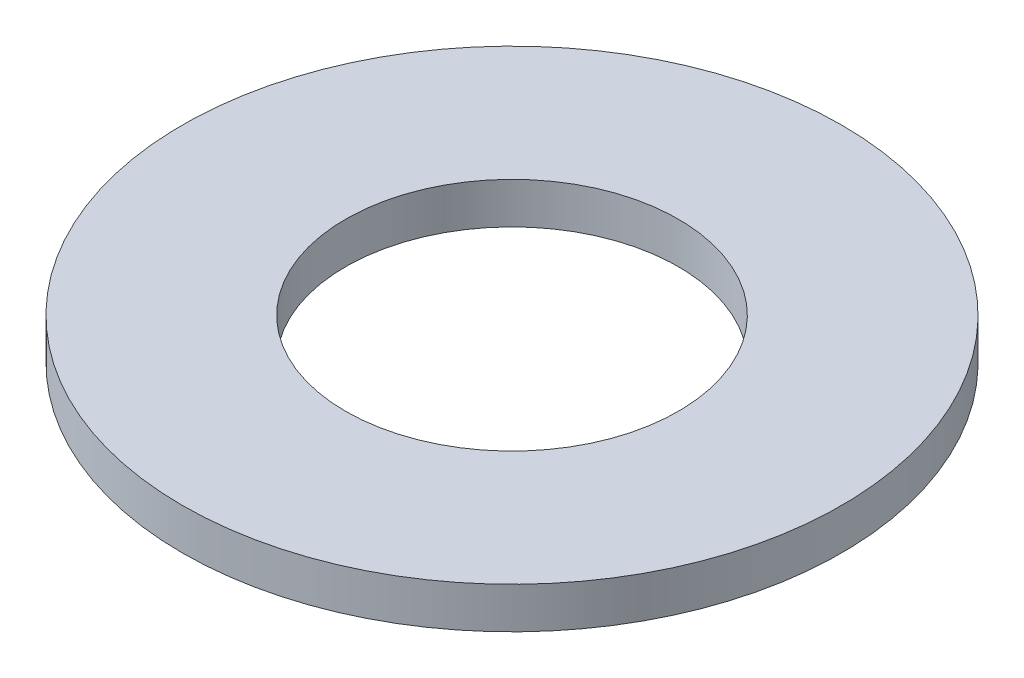
ISO-10303-21;
HEADER;
FILE_DESCRIPTION(('STEP AP214'),'2;1');
FILE_NAME('part.step','',(''),(''),'','','');
FILE_SCHEMA(('AUTOMOTIVE_DESIGN { 1 0 10303 214 1 1 1 1 }'));
ENDSEC;
DATA;
#1=APPLICATION_CONTEXT('core data for automotive mechanical design processes');
#2=APPLICATION_PROTOCOL_DEFINITION('international standard','automotive_design',2000,#1);
#3=PRODUCT_CONTEXT('',#1,'mechanical');
#4=PRODUCT('Part','Part','',(#3));
#5=PRODUCT_RELATED_PRODUCT_CATEGORY('part','',(#4));
#6=PRODUCT_DEFINITION_FORMATION('','',#4);
#7=PRODUCT_DEFINITION_CONTEXT('part definition',#1,'design');
#8=PRODUCT_DEFINITION('design','',#6,#7);
#9=PRODUCT_DEFINITION_SHAPE('','',#8);
#10=(LENGTH_UNIT() NAMED_UNIT(*) SI_UNIT(.MILLI.,.METRE.));
#11=(NAMED_UNIT(*) PLANE_ANGLE_UNIT() SI_UNIT($,.RADIAN.));
#12=(NAMED_UNIT(*) SI_UNIT($,.STERADIAN.) SOLID_ANGLE_UNIT());
#13=UNCERTAINTY_MEASURE_WITH_UNIT(LENGTH_MEASURE(1.E-05),#10,'distance_accuracy_value','');
#14=(GEOMETRIC_REPRESENTATION_CONTEXT(3) GLOBAL_UNCERTAINTY_ASSIGNED_CONTEXT((#13)) GLOBAL_UNIT_ASSIGNED_CONTEXT((#10,
#11,#12)) REPRESENTATION_CONTEXT('',''));
#15=CARTESIAN_POINT('',(0.,0.,0.));
#16=DIRECTION('',(0.,0.,1.));
#17=DIRECTION('',(1.,0.,0.));
#18=AXIS2_PLACEMENT_3D('',#15,#16,#17);
#19=CARTESIAN_POINT('',(0.,0.79375,0.));
#20=DIRECTION('',(0.,1.,0.));
#21=DIRECTION('',(0.,0.,1.));
#22=AXIS2_PLACEMENT_3D('',#19,#20,#21);
#23=PLANE('',#22);
#24=CARTESIAN_POINT('',(0.,0.79375,0.));
#25=DIRECTION('',(0.,1.,0.));
#26=DIRECTION('',(0.,0.,1.));
#27=AXIS2_PLACEMENT_3D('',#24,#25,#26);
#28=CIRCLE('',#27,12.7);
#29=CARTESIAN_POINT('',(0.,0.79375,12.7));
#30=VERTEX_POINT('',#29);
#31=EDGE_CURVE('E10',#30,#30,#28,.T.);
#32=ORIENTED_EDGE('',*,*,#31,.T.);
#33=EDGE_LOOP('',(#32));
#34=FACE_BOUND('',#33,.T.);
#35=CARTESIAN_POINT('',(0.,0.79375,0.));
#36=DIRECTION('',(0.,1.,0.));
#37=DIRECTION('',(0.,0.,1.));
#38=AXIS2_PLACEMENT_3D('',#35,#36,#37);
#39=CIRCLE('',#38,6.4135);
#40=CARTESIAN_POINT('',(0.,0.79375,6.4135));
#41=VERTEX_POINT('',#40);
#42=EDGE_CURVE('E48',#41,#41,#39,.T.);
#43=ORIENTED_EDGE('',*,*,#42,.F.);
#44=EDGE_LOOP('',(#43));
#45=FACE_BOUND('',#44,.T.);
#46=ADVANCED_FACE('F37',(#34,#45),#23,.T.);
#47=CARTESIAN_POINT('',(0.,-0.79375,0.));
#48=DIRECTION('',(0.,1.,0.));
#49=DIRECTION('',(0.,0.,1.));
#50=AXIS2_PLACEMENT_3D('',#47,#48,#49);
#51=PLANE('',#50);
#52=CARTESIAN_POINT('',(0.,-0.79375,0.));
#53=DIRECTION('',(0.,1.,0.));
#54=DIRECTION('',(0.,0.,1.));
#55=AXIS2_PLACEMENT_3D('',#52,#53,#54);
#56=CIRCLE('',#55,12.7);
#57=CARTESIAN_POINT('',(0.,-0.79375,12.7));
#58=VERTEX_POINT('',#57);
#59=EDGE_CURVE('E41',#58,#58,#56,.T.);
#60=ORIENTED_EDGE('',*,*,#59,.F.);
#61=EDGE_LOOP('',(#60));
#62=FACE_BOUND('',#61,.T.);
#63=CARTESIAN_POINT('',(0.,-0.79375,0.));
#64=DIRECTION('',(0.,1.,0.));
#65=DIRECTION('',(0.,0.,1.));
#66=AXIS2_PLACEMENT_3D('',#63,#64,#65);
#67=CIRCLE('',#66,6.4135);
#68=CARTESIAN_POINT('',(0.,-0.79375,6.4135));
#69=VERTEX_POINT('',#68);
#70=EDGE_CURVE('E50',#69,#69,#67,.T.);
#71=ORIENTED_EDGE('',*,*,#70,.T.);
#72=EDGE_LOOP('',(#71));
#73=FACE_BOUND('',#72,.T.);
#74=ADVANCED_FACE('F60',(#62,#73),#51,.F.);
#75=CARTESIAN_POINT('',(0.,0.79375,0.));
#76=DIRECTION('',(0.,-1.,0.));
#77=DIRECTION('',(0.,0.,-1.));
#78=AXIS2_PLACEMENT_3D('',#75,#76,#77);
#79=CYLINDRICAL_SURFACE('',#78,12.7);
#80=ORIENTED_EDGE('',*,*,#31,.F.);
#81=EDGE_LOOP('',(#80));
#82=FACE_BOUND('',#81,.T.);
#83=ORIENTED_EDGE('',*,*,#59,.T.);
#84=EDGE_LOOP('',(#83));
#85=FACE_BOUND('',#84,.T.);
#86=ADVANCED_FACE('F39',(#82,#85),#79,.T.);
#87=CARTESIAN_POINT('',(0.,0.79375,0.));
#88=DIRECTION('',(0.,-1.,0.));
#89=DIRECTION('',(0.,0.,-1.));
#90=AXIS2_PLACEMENT_3D('',#87,#88,#89);
#91=CYLINDRICAL_SURFACE('',#90,6.4135);
#92=ORIENTED_EDGE('',*,*,#42,.T.);
#93=EDGE_LOOP('',(#92));
#94=FACE_BOUND('',#93,.T.);
#95=ORIENTED_EDGE('',*,*,#70,.F.);
#96=EDGE_LOOP('',(#95));
#97=FACE_BOUND('',#96,.T.);
#98=ADVANCED_FACE('F56',(#94,#97),#91,.F.);
#99=CLOSED_SHELL('',(#46,#74,#86,#98));
#100=MANIFOLD_SOLID_BREP('B2',#99);
#101=ADVANCED_BREP_SHAPE_REPRESENTATION('',(#18,#100),#14);
#102=SHAPE_DEFINITION_REPRESENTATION(#9,#101);
ENDSEC;
END-ISO-10303-21;
